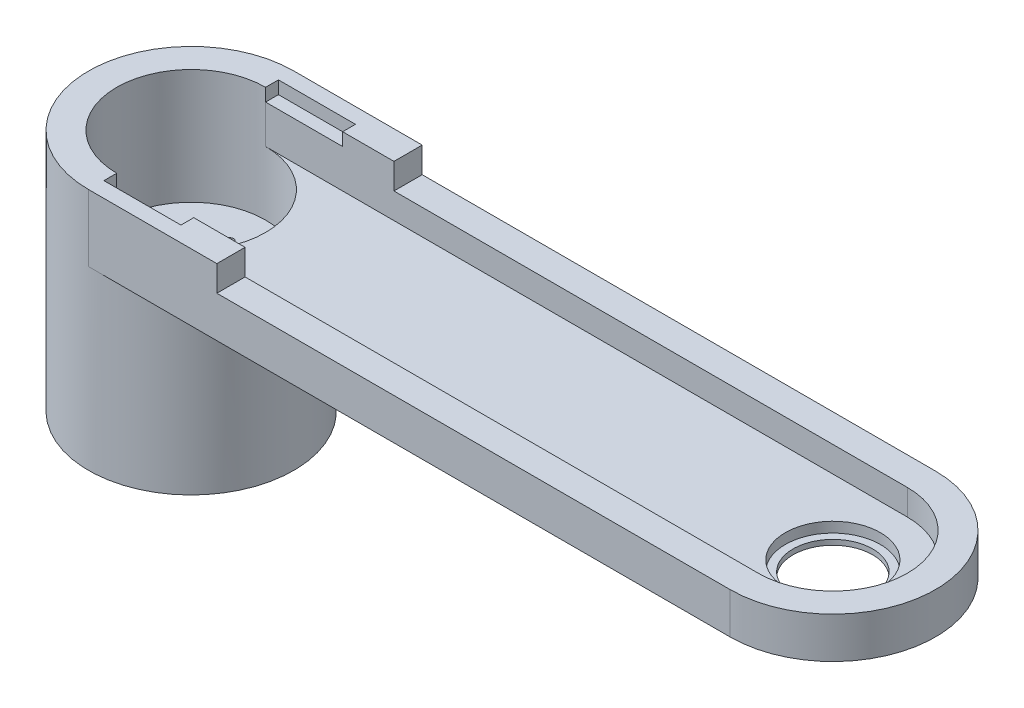
ISO-10303-21;
HEADER;
FILE_DESCRIPTION(('STEP AP214'),'2;1');
FILE_NAME('part.step','',(''),(''),'','','');
FILE_SCHEMA(('AUTOMOTIVE_DESIGN { 1 0 10303 214 1 1 1 1 }'));
ENDSEC;
DATA;
#1=APPLICATION_CONTEXT('core data for automotive mechanical design processes');
#2=APPLICATION_PROTOCOL_DEFINITION('international standard','automotive_design',2000,#1);
#3=PRODUCT_CONTEXT('',#1,'mechanical');
#4=PRODUCT('Part','Part','',(#3));
#5=PRODUCT_RELATED_PRODUCT_CATEGORY('part','',(#4));
#6=PRODUCT_DEFINITION_FORMATION('','',#4);
#7=PRODUCT_DEFINITION_CONTEXT('part definition',#1,'design');
#8=PRODUCT_DEFINITION('design','',#6,#7);
#9=PRODUCT_DEFINITION_SHAPE('','',#8);
#10=(LENGTH_UNIT() NAMED_UNIT(*) SI_UNIT(.MILLI.,.METRE.));
#11=(NAMED_UNIT(*) PLANE_ANGLE_UNIT() SI_UNIT($,.RADIAN.));
#12=(NAMED_UNIT(*) SI_UNIT($,.STERADIAN.) SOLID_ANGLE_UNIT());
#13=UNCERTAINTY_MEASURE_WITH_UNIT(LENGTH_MEASURE(1.E-05),#10,'distance_accuracy_value','');
#14=(GEOMETRIC_REPRESENTATION_CONTEXT(3) GLOBAL_UNCERTAINTY_ASSIGNED_CONTEXT((#13)) GLOBAL_UNIT_ASSIGNED_CONTEXT((#10,
#11,#12)) REPRESENTATION_CONTEXT('',''));
#15=CARTESIAN_POINT('',(0.,0.,0.));
#16=DIRECTION('',(0.,0.,1.));
#17=DIRECTION('',(1.,0.,0.));
#18=AXIS2_PLACEMENT_3D('',#15,#16,#17);
#19=CARTESIAN_POINT('',(250.,20.,0.));
#20=DIRECTION('',(0.,-1.,0.));
#21=DIRECTION('',(0.,0.,-1.));
#22=AXIS2_PLACEMENT_3D('',#19,#20,#21);
#23=CYLINDRICAL_SURFACE('',#22,40.);
#24=CARTESIAN_POINT('',(250.,10.,0.));
#25=DIRECTION('',(0.,1.,0.));
#26=DIRECTION('',(0.,0.,1.));
#27=AXIS2_PLACEMENT_3D('',#24,#25,#26);
#28=CIRCLE('',#27,40.);
#29=CARTESIAN_POINT('',(250.,10.,40.));
#30=VERTEX_POINT('',#29);
#31=CARTESIAN_POINT('',(250.,10.,-40.));
#32=VERTEX_POINT('',#31);
#33=EDGE_CURVE('E165',#30,#32,#28,.T.);
#34=ORIENTED_EDGE('',*,*,#33,.F.);
#35=DIRECTION('',(0.,-1.,0.));
#36=VECTOR('',#35,1.);
#37=CARTESIAN_POINT('',(250.,20.,40.));
#38=LINE('',#37,#36);
#39=CARTESIAN_POINT('',(250.,-6.,40.));
#40=VERTEX_POINT('',#39);
#41=EDGE_CURVE('E189',#30,#40,#38,.T.);
#42=ORIENTED_EDGE('',*,*,#41,.T.);
#43=CARTESIAN_POINT('',(250.,-6.,0.));
#44=DIRECTION('',(0.,-1.,0.));
#45=DIRECTION('',(0.,0.,-1.));
#46=AXIS2_PLACEMENT_3D('',#43,#44,#45);
#47=CIRCLE('',#46,40.);
#48=CARTESIAN_POINT('',(250.,-6.,-40.));
#49=VERTEX_POINT('',#48);
#50=EDGE_CURVE('E188',#49,#40,#47,.T.);
#51=ORIENTED_EDGE('',*,*,#50,.F.);
#52=DIRECTION('',(0.,-1.,0.));
#53=VECTOR('',#52,1.);
#54=CARTESIAN_POINT('',(250.,20.,-40.));
#55=LINE('',#54,#53);
#56=EDGE_CURVE('E181',#32,#49,#55,.T.);
#57=ORIENTED_EDGE('',*,*,#56,.F.);
#58=EDGE_LOOP('',(#34,#42,#51,#57));
#59=FACE_BOUND('',#58,.T.);
#60=ADVANCED_FACE('F37',(#59),#23,.T.);
#61=CARTESIAN_POINT('',(250.,20.,0.));
#62=DIRECTION('',(0.,-1.,0.));
#63=DIRECTION('',(0.,0.,-1.));
#64=AXIS2_PLACEMENT_3D('',#61,#62,#63);
#65=CYLINDRICAL_SURFACE('',#64,29.);
#66=DIRECTION('',(0.,-1.,0.));
#67=VECTOR('',#66,1.);
#68=CARTESIAN_POINT('',(250.,20.,29.));
#69=LINE('',#68,#67);
#70=CARTESIAN_POINT('',(250.,10.,29.));
#71=VERTEX_POINT('',#70);
#72=CARTESIAN_POINT('',(250.,0.,29.));
#73=VERTEX_POINT('',#72);
#74=EDGE_CURVE('E231',#71,#73,#69,.T.);
#75=ORIENTED_EDGE('',*,*,#74,.F.);
#76=CARTESIAN_POINT('',(250.,10.,0.));
#77=DIRECTION('',(0.,1.,0.));
#78=DIRECTION('',(0.,0.,1.));
#79=AXIS2_PLACEMENT_3D('',#76,#77,#78);
#80=CIRCLE('',#79,29.);
#81=CARTESIAN_POINT('',(250.,10.,-29.));
#82=VERTEX_POINT('',#81);
#83=EDGE_CURVE('E225',#71,#82,#80,.T.);
#84=ORIENTED_EDGE('',*,*,#83,.T.);
#85=DIRECTION('',(0.,-1.,0.));
#86=VECTOR('',#85,1.);
#87=CARTESIAN_POINT('',(250.,20.,-29.));
#88=LINE('',#87,#86);
#89=CARTESIAN_POINT('',(250.,0.,-29.));
#90=VERTEX_POINT('',#89);
#91=EDGE_CURVE('E223',#82,#90,#88,.T.);
#92=ORIENTED_EDGE('',*,*,#91,.T.);
#93=CARTESIAN_POINT('',(250.,0.,0.));
#94=DIRECTION('',(0.,1.,0.));
#95=DIRECTION('',(0.,0.,1.));
#96=AXIS2_PLACEMENT_3D('',#93,#94,#95);
#97=CIRCLE('',#96,29.);
#98=EDGE_CURVE('E319',#73,#90,#97,.T.);
#99=ORIENTED_EDGE('',*,*,#98,.F.);
#100=EDGE_LOOP('',(#75,#84,#92,#99));
#101=FACE_BOUND('',#100,.T.);
#102=ADVANCED_FACE('F229',(#101),#65,.F.);
#103=CARTESIAN_POINT('',(0.,20.,0.));
#104=DIRECTION('',(0.,-1.,0.));
#105=DIRECTION('',(0.,0.,-1.));
#106=AXIS2_PLACEMENT_3D('',#103,#104,#105);
#107=CYLINDRICAL_SURFACE('',#106,40.);
#108=CARTESIAN_POINT('',(0.,-6.,0.));
#109=DIRECTION('',(0.,1.,0.));
#110=DIRECTION('',(0.,0.,-1.));
#111=AXIS2_PLACEMENT_3D('',#108,#109,#110);
#112=CIRCLE('',#111,40.);
#113=CARTESIAN_POINT('',(0.,-6.,40.));
#114=VERTEX_POINT('',#113);
#115=CARTESIAN_POINT('',(0.,-6.,-40.));
#116=VERTEX_POINT('',#115);
#117=EDGE_CURVE('E295',#114,#116,#112,.T.);
#118=ORIENTED_EDGE('',*,*,#117,.F.);
#119=DIRECTION('',(0.,-1.,0.));
#120=VECTOR('',#119,1.);
#121=CARTESIAN_POINT('',(0.,20.,40.));
#122=LINE('',#121,#120);
#123=CARTESIAN_POINT('',(0.,20.,40.));
#124=VERTEX_POINT('',#123);
#125=EDGE_CURVE('E192',#124,#114,#122,.T.);
#126=ORIENTED_EDGE('',*,*,#125,.F.);
#127=CARTESIAN_POINT('',(0.,20.,0.));
#128=DIRECTION('',(0.,1.,0.));
#129=DIRECTION('',(0.,0.,1.));
#130=AXIS2_PLACEMENT_3D('',#127,#128,#129);
#131=CIRCLE('',#130,40.);
#132=CARTESIAN_POINT('',(0.,20.,-40.));
#133=VERTEX_POINT('',#132);
#134=EDGE_CURVE('E333',#133,#124,#131,.T.);
#135=ORIENTED_EDGE('',*,*,#134,.F.);
#136=DIRECTION('',(0.,-1.,0.));
#137=VECTOR('',#136,1.);
#138=CARTESIAN_POINT('',(0.,20.,-40.));
#139=LINE('',#138,#137);
#140=EDGE_CURVE('E190',#133,#116,#139,.T.);
#141=ORIENTED_EDGE('',*,*,#140,.T.);
#142=EDGE_LOOP('',(#118,#126,#135,#141));
#143=FACE_BOUND('',#142,.T.);
#144=CARTESIAN_POINT('',(0.,-74.8,0.));
#145=DIRECTION('',(0.,-1.,0.));
#146=DIRECTION('',(0.,0.,-1.));
#147=AXIS2_PLACEMENT_3D('',#144,#145,#146);
#148=CIRCLE('',#147,40.);
#149=CARTESIAN_POINT('',(0.,-74.8,-40.));
#150=VERTEX_POINT('',#149);
#151=EDGE_CURVE('E418',#150,#150,#148,.T.);
#152=ORIENTED_EDGE('',*,*,#151,.F.);
#153=EDGE_LOOP('',(#152));
#154=FACE_BOUND('',#153,.T.);
#155=ADVANCED_FACE('F39',(#143,#154),#107,.T.);
#156=CARTESIAN_POINT('',(0.,20.,0.));
#157=DIRECTION('',(0.,1.,0.));
#158=DIRECTION('',(0.,0.,1.));
#159=AXIS2_PLACEMENT_3D('',#156,#157,#158);
#160=PLANE('',#159);
#161=DIRECTION('',(0.,0.,1.));
#162=VECTOR('',#161,1.);
#163=CARTESIAN_POINT('',(50.,20.,-40.));
#164=LINE('',#163,#162);
#165=CARTESIAN_POINT('',(50.,20.,-40.));
#166=VERTEX_POINT('',#165);
#167=CARTESIAN_POINT('',(50.,20.,-29.));
#168=VERTEX_POINT('',#167);
#169=EDGE_CURVE('E175',#166,#168,#164,.T.);
#170=ORIENTED_EDGE('',*,*,#169,.F.);
#171=DIRECTION('',(-1.,0.,0.));
#172=VECTOR('',#171,1.);
#173=CARTESIAN_POINT('',(0.,20.,-40.));
#174=LINE('',#173,#172);
#175=EDGE_CURVE('E194',#166,#133,#174,.T.);
#176=ORIENTED_EDGE('',*,*,#175,.T.);
#177=ORIENTED_EDGE('',*,*,#134,.T.);
#178=DIRECTION('',(1.,0.,0.));
#179=VECTOR('',#178,1.);
#180=CARTESIAN_POINT('',(0.,20.,40.));
#181=LINE('',#180,#179);
#182=CARTESIAN_POINT('',(50.,20.,40.));
#183=VERTEX_POINT('',#182);
#184=EDGE_CURVE('E336',#124,#183,#181,.T.);
#185=ORIENTED_EDGE('',*,*,#184,.T.);
#186=CARTESIAN_POINT('',(50.,20.,29.));
#187=VERTEX_POINT('',#186);
#188=EDGE_CURVE('E416',#187,#183,#164,.T.);
#189=ORIENTED_EDGE('',*,*,#188,.F.);
#190=DIRECTION('',(1.,0.,0.));
#191=VECTOR('',#190,1.);
#192=CARTESIAN_POINT('',(0.,20.,29.));
#193=LINE('',#192,#191);
#194=CARTESIAN_POINT('',(30.,20.,29.));
#195=VERTEX_POINT('',#194);
#196=EDGE_CURVE('E310',#195,#187,#193,.T.);
#197=ORIENTED_EDGE('',*,*,#196,.F.);
#198=DIRECTION('',(0.,0.,1.));
#199=VECTOR('',#198,1.);
#200=CARTESIAN_POINT('',(30.,20.,-69.4138126514911));
#201=LINE('',#200,#199);
#202=CARTESIAN_POINT('',(30.,20.,34.));
#203=VERTEX_POINT('',#202);
#204=EDGE_CURVE('E281',#195,#203,#201,.T.);
#205=ORIENTED_EDGE('',*,*,#204,.T.);
#206=DIRECTION('',(1.,0.,0.));
#207=VECTOR('',#206,1.);
#208=CARTESIAN_POINT('',(0.,20.,34.));
#209=LINE('',#208,#207);
#210=CARTESIAN_POINT('',(0.,20.,34.));
#211=VERTEX_POINT('',#210);
#212=EDGE_CURVE('E252',#211,#203,#209,.T.);
#213=ORIENTED_EDGE('',*,*,#212,.F.);
#214=DIRECTION('',(0.,0.,1.));
#215=VECTOR('',#214,1.);
#216=CARTESIAN_POINT('',(0.,20.,-69.4138126514911));
#217=LINE('',#216,#215);
#218=CARTESIAN_POINT('',(0.,20.,29.));
#219=VERTEX_POINT('',#218);
#220=EDGE_CURVE('E277',#219,#211,#217,.T.);
#221=ORIENTED_EDGE('',*,*,#220,.F.);
#222=CARTESIAN_POINT('',(0.,20.,0.));
#223=DIRECTION('',(0.,1.,0.));
#224=DIRECTION('',(0.,0.,1.));
#225=AXIS2_PLACEMENT_3D('',#222,#223,#224);
#226=CIRCLE('',#225,29.);
#227=CARTESIAN_POINT('',(0.,20.,-29.));
#228=VERTEX_POINT('',#227);
#229=EDGE_CURVE('E307',#228,#219,#226,.T.);
#230=ORIENTED_EDGE('',*,*,#229,.F.);
#231=CARTESIAN_POINT('',(0.,20.,-34.));
#232=VERTEX_POINT('',#231);
#233=EDGE_CURVE('E270',#232,#228,#217,.T.);
#234=ORIENTED_EDGE('',*,*,#233,.F.);
#235=DIRECTION('',(1.,0.,0.));
#236=VECTOR('',#235,1.);
#237=CARTESIAN_POINT('',(0.,20.,-34.));
#238=LINE('',#237,#236);
#239=CARTESIAN_POINT('',(30.,20.,-34.));
#240=VERTEX_POINT('',#239);
#241=EDGE_CURVE('E269',#232,#240,#238,.T.);
#242=ORIENTED_EDGE('',*,*,#241,.T.);
#243=CARTESIAN_POINT('',(30.,20.,-29.));
#244=VERTEX_POINT('',#243);
#245=EDGE_CURVE('E278',#240,#244,#201,.T.);
#246=ORIENTED_EDGE('',*,*,#245,.T.);
#247=DIRECTION('',(-1.,0.,0.));
#248=VECTOR('',#247,1.);
#249=CARTESIAN_POINT('',(0.,20.,-29.));
#250=LINE('',#249,#248);
#251=EDGE_CURVE('E314',#168,#244,#250,.T.);
#252=ORIENTED_EDGE('',*,*,#251,.F.);
#253=EDGE_LOOP('',(#170,#176,#177,#185,#189,#197,#205,#213,#221,#230,#234,#242,#246,#252));
#254=FACE_BOUND('',#253,.T.);
#255=ADVANCED_FACE('F341',(#254),#160,.T.);
#256=CARTESIAN_POINT('',(0.,20.,40.));
#257=DIRECTION('',(0.,0.,-1.));
#258=DIRECTION('',(-1.,0.,0.));
#259=AXIS2_PLACEMENT_3D('',#256,#257,#258);
#260=PLANE('',#259);
#261=DIRECTION('',(1.,0.,0.));
#262=VECTOR('',#261,1.);
#263=CARTESIAN_POINT('',(50.,10.,40.));
#264=LINE('',#263,#262);
#265=CARTESIAN_POINT('',(50.,10.,40.));
#266=VERTEX_POINT('',#265);
#267=EDGE_CURVE('E171',#266,#30,#264,.T.);
#268=ORIENTED_EDGE('',*,*,#267,.F.);
#269=DIRECTION('',(0.,1.,0.));
#270=VECTOR('',#269,1.);
#271=CARTESIAN_POINT('',(50.,10.,40.));
#272=LINE('',#271,#270);
#273=EDGE_CURVE('E233',#266,#183,#272,.T.);
#274=ORIENTED_EDGE('',*,*,#273,.T.);
#275=ORIENTED_EDGE('',*,*,#184,.F.);
#276=ORIENTED_EDGE('',*,*,#125,.T.);
#277=DIRECTION('',(-1.,0.,0.));
#278=VECTOR('',#277,1.);
#279=CARTESIAN_POINT('',(0.,-6.,40.));
#280=LINE('',#279,#278);
#281=EDGE_CURVE('E292',#40,#114,#280,.T.);
#282=ORIENTED_EDGE('',*,*,#281,.F.);
#283=ORIENTED_EDGE('',*,*,#41,.F.);
#284=EDGE_LOOP('',(#268,#274,#275,#276,#282,#283));
#285=FACE_BOUND('',#284,.T.);
#286=ADVANCED_FACE('F349',(#285),#260,.F.);
#287=CARTESIAN_POINT('',(0.,20.,-40.));
#288=DIRECTION('',(0.,0.,1.));
#289=DIRECTION('',(1.,0.,0.));
#290=AXIS2_PLACEMENT_3D('',#287,#288,#289);
#291=PLANE('',#290);
#292=ORIENTED_EDGE('',*,*,#175,.F.);
#293=DIRECTION('',(0.,1.,0.));
#294=VECTOR('',#293,1.);
#295=CARTESIAN_POINT('',(50.,10.,-40.));
#296=LINE('',#295,#294);
#297=CARTESIAN_POINT('',(50.,10.,-40.));
#298=VERTEX_POINT('',#297);
#299=EDGE_CURVE('E183',#298,#166,#296,.T.);
#300=ORIENTED_EDGE('',*,*,#299,.F.);
#301=DIRECTION('',(-1.,0.,0.));
#302=VECTOR('',#301,1.);
#303=CARTESIAN_POINT('',(250.,10.,-40.));
#304=LINE('',#303,#302);
#305=EDGE_CURVE('E168',#32,#298,#304,.T.);
#306=ORIENTED_EDGE('',*,*,#305,.F.);
#307=ORIENTED_EDGE('',*,*,#56,.T.);
#308=DIRECTION('',(1.,0.,0.));
#309=VECTOR('',#308,1.);
#310=CARTESIAN_POINT('',(250.,-6.,-40.));
#311=LINE('',#310,#309);
#312=EDGE_CURVE('E298',#116,#49,#311,.T.);
#313=ORIENTED_EDGE('',*,*,#312,.F.);
#314=ORIENTED_EDGE('',*,*,#140,.F.);
#315=EDGE_LOOP('',(#292,#300,#306,#307,#313,#314));
#316=FACE_BOUND('',#315,.T.);
#317=ADVANCED_FACE('F179',(#316),#291,.F.);
#318=CARTESIAN_POINT('',(0.,20.,0.));
#319=DIRECTION('',(0.,-1.,0.));
#320=DIRECTION('',(0.,0.,-1.));
#321=AXIS2_PLACEMENT_3D('',#318,#319,#320);
#322=CYLINDRICAL_SURFACE('',#321,29.);
#323=DIRECTION('',(0.,-1.,0.));
#324=VECTOR('',#323,1.);
#325=CARTESIAN_POINT('',(0.,20.,29.));
#326=LINE('',#325,#324);
#327=CARTESIAN_POINT('',(0.,15.,29.));
#328=VERTEX_POINT('',#327);
#329=EDGE_CURVE('E330',#219,#328,#326,.T.);
#330=ORIENTED_EDGE('',*,*,#329,.T.);
#331=CARTESIAN_POINT('',(0.,0.,29.));
#332=VERTEX_POINT('',#331);
#333=EDGE_CURVE('E329',#328,#332,#326,.T.);
#334=ORIENTED_EDGE('',*,*,#333,.T.);
#335=CARTESIAN_POINT('',(0.,0.,0.));
#336=DIRECTION('',(0.,-1.,0.));
#337=DIRECTION('',(0.,0.,-1.));
#338=AXIS2_PLACEMENT_3D('',#335,#336,#337);
#339=CIRCLE('',#338,29.);
#340=CARTESIAN_POINT('',(0.,0.,-29.));
#341=VERTEX_POINT('',#340);
#342=EDGE_CURVE('E303',#341,#332,#339,.T.);
#343=ORIENTED_EDGE('',*,*,#342,.F.);
#344=DIRECTION('',(0.,-1.,0.));
#345=VECTOR('',#344,1.);
#346=CARTESIAN_POINT('',(0.,20.,-29.));
#347=LINE('',#346,#345);
#348=CARTESIAN_POINT('',(0.,15.,-29.));
#349=VERTEX_POINT('',#348);
#350=EDGE_CURVE('E316',#349,#341,#347,.T.);
#351=ORIENTED_EDGE('',*,*,#350,.F.);
#352=EDGE_CURVE('E324',#228,#349,#347,.T.);
#353=ORIENTED_EDGE('',*,*,#352,.F.);
#354=ORIENTED_EDGE('',*,*,#229,.T.);
#355=EDGE_LOOP('',(#330,#334,#343,#351,#353,#354));
#356=FACE_BOUND('',#355,.T.);
#357=CARTESIAN_POINT('',(0.,-24.8,0.));
#358=DIRECTION('',(0.,-1.,0.));
#359=DIRECTION('',(0.,0.,-1.));
#360=AXIS2_PLACEMENT_3D('',#357,#358,#359);
#361=CIRCLE('',#360,29.);
#362=CARTESIAN_POINT('',(0.,-24.8,-29.));
#363=VERTEX_POINT('',#362);
#364=EDGE_CURVE('E300',#363,#363,#361,.T.);
#365=ORIENTED_EDGE('',*,*,#364,.T.);
#366=EDGE_LOOP('',(#365));
#367=FACE_BOUND('',#366,.T.);
#368=ADVANCED_FACE('F382',(#356,#367),#322,.F.);
#369=CARTESIAN_POINT('',(0.,20.,29.));
#370=DIRECTION('',(0.,0.,-1.));
#371=DIRECTION('',(-1.,0.,0.));
#372=AXIS2_PLACEMENT_3D('',#369,#370,#371);
#373=PLANE('',#372);
#374=DIRECTION('',(0.,1.,0.));
#375=VECTOR('',#374,1.);
#376=CARTESIAN_POINT('',(50.,20.,29.));
#377=LINE('',#376,#375);
#378=CARTESIAN_POINT('',(50.,10.,29.));
#379=VERTEX_POINT('',#378);
#380=EDGE_CURVE('E235',#379,#187,#377,.T.);
#381=ORIENTED_EDGE('',*,*,#380,.F.);
#382=DIRECTION('',(1.,0.,0.));
#383=VECTOR('',#382,1.);
#384=CARTESIAN_POINT('',(0.,10.,29.));
#385=LINE('',#384,#383);
#386=EDGE_CURVE('E232',#379,#71,#385,.T.);
#387=ORIENTED_EDGE('',*,*,#386,.T.);
#388=ORIENTED_EDGE('',*,*,#74,.T.);
#389=DIRECTION('',(1.,0.,0.));
#390=VECTOR('',#389,1.);
#391=CARTESIAN_POINT('',(0.,0.,29.));
#392=LINE('',#391,#390);
#393=EDGE_CURVE('E306',#332,#73,#392,.T.);
#394=ORIENTED_EDGE('',*,*,#393,.F.);
#395=ORIENTED_EDGE('',*,*,#333,.F.);
#396=DIRECTION('',(-1.,0.,0.));
#397=VECTOR('',#396,1.);
#398=CARTESIAN_POINT('',(0.,15.,29.));
#399=LINE('',#398,#397);
#400=CARTESIAN_POINT('',(30.,15.,29.));
#401=VERTEX_POINT('',#400);
#402=EDGE_CURVE('E288',#401,#328,#399,.T.);
#403=ORIENTED_EDGE('',*,*,#402,.F.);
#404=DIRECTION('',(0.,-1.,0.));
#405=VECTOR('',#404,1.);
#406=CARTESIAN_POINT('',(30.,20.,29.));
#407=LINE('',#406,#405);
#408=EDGE_CURVE('E208',#195,#401,#407,.T.);
#409=ORIENTED_EDGE('',*,*,#408,.F.);
#410=ORIENTED_EDGE('',*,*,#196,.T.);
#411=EDGE_LOOP('',(#381,#387,#388,#394,#395,#403,#409,#410));
#412=FACE_BOUND('',#411,.T.);
#413=ADVANCED_FACE('F389',(#412),#373,.T.);
#414=CARTESIAN_POINT('',(0.,20.,-29.));
#415=DIRECTION('',(0.,0.,1.));
#416=DIRECTION('',(1.,0.,0.));
#417=AXIS2_PLACEMENT_3D('',#414,#415,#416);
#418=PLANE('',#417);
#419=DIRECTION('',(0.,-1.,0.));
#420=VECTOR('',#419,1.);
#421=CARTESIAN_POINT('',(50.,20.,-29.));
#422=LINE('',#421,#420);
#423=CARTESIAN_POINT('',(50.,10.,-29.));
#424=VERTEX_POINT('',#423);
#425=EDGE_CURVE('E13',#168,#424,#422,.T.);
#426=ORIENTED_EDGE('',*,*,#425,.F.);
#427=ORIENTED_EDGE('',*,*,#251,.T.);
#428=DIRECTION('',(0.,1.,0.));
#429=VECTOR('',#428,1.);
#430=CARTESIAN_POINT('',(30.,20.,-29.));
#431=LINE('',#430,#429);
#432=CARTESIAN_POINT('',(30.,15.,-29.));
#433=VERTEX_POINT('',#432);
#434=EDGE_CURVE('E214',#433,#244,#431,.T.);
#435=ORIENTED_EDGE('',*,*,#434,.F.);
#436=DIRECTION('',(1.,0.,0.));
#437=VECTOR('',#436,1.);
#438=CARTESIAN_POINT('',(0.,15.,-29.));
#439=LINE('',#438,#437);
#440=EDGE_CURVE('E199',#349,#433,#439,.T.);
#441=ORIENTED_EDGE('',*,*,#440,.F.);
#442=ORIENTED_EDGE('',*,*,#350,.T.);
#443=DIRECTION('',(-1.,0.,0.));
#444=VECTOR('',#443,1.);
#445=CARTESIAN_POINT('',(0.,0.,-29.));
#446=LINE('',#445,#444);
#447=EDGE_CURVE('E311',#90,#341,#446,.T.);
#448=ORIENTED_EDGE('',*,*,#447,.F.);
#449=ORIENTED_EDGE('',*,*,#91,.F.);
#450=DIRECTION('',(-1.,0.,0.));
#451=VECTOR('',#450,1.);
#452=CARTESIAN_POINT('',(0.,10.,-29.));
#453=LINE('',#452,#451);
#454=EDGE_CURVE('E45',#82,#424,#453,.T.);
#455=ORIENTED_EDGE('',*,*,#454,.T.);
#456=EDGE_LOOP('',(#426,#427,#435,#441,#442,#448,#449,#455));
#457=FACE_BOUND('',#456,.T.);
#458=ADVANCED_FACE('F220',(#457),#418,.T.);
#459=CARTESIAN_POINT('',(0.,0.,0.));
#460=DIRECTION('',(0.,-1.,0.));
#461=DIRECTION('',(0.,0.,-1.));
#462=AXIS2_PLACEMENT_3D('',#459,#460,#461);
#463=PLANE('',#462);
#464=CARTESIAN_POINT('',(250.,0.,0.));
#465=DIRECTION('',(0.,1.,0.));
#466=DIRECTION('',(0.,0.,1.));
#467=AXIS2_PLACEMENT_3D('',#464,#465,#466);
#468=CIRCLE('',#467,18.5);
#469=CARTESIAN_POINT('',(250.,0.,18.5));
#470=VERTEX_POINT('',#469);
#471=EDGE_CURVE('E248',#470,#470,#468,.T.);
#472=ORIENTED_EDGE('',*,*,#471,.F.);
#473=EDGE_LOOP('',(#472));
#474=FACE_BOUND('',#473,.T.);
#475=ORIENTED_EDGE('',*,*,#342,.T.);
#476=ORIENTED_EDGE('',*,*,#393,.T.);
#477=ORIENTED_EDGE('',*,*,#98,.T.);
#478=ORIENTED_EDGE('',*,*,#447,.T.);
#479=EDGE_LOOP('',(#475,#476,#477,#478));
#480=FACE_BOUND('',#479,.T.);
#481=ADVANCED_FACE('F365',(#474,#480),#463,.F.);
#482=CARTESIAN_POINT('',(0.,-24.8,0.));
#483=DIRECTION('',(0.,-1.,0.));
#484=DIRECTION('',(0.,0.,-1.));
#485=AXIS2_PLACEMENT_3D('',#482,#483,#484);
#486=PLANE('',#485);
#487=CARTESIAN_POINT('',(15.0000000000004,-24.8,-4.24488671257339E-13));
#488=DIRECTION('',(0.,-1.,0.));
#489=DIRECTION('',(0.,0.,-1.));
#490=AXIS2_PLACEMENT_3D('',#487,#488,#489);
#491=CIRCLE('',#490,1.50000000000033);
#492=CARTESIAN_POINT('',(15.0000000000004,-24.8,-1.50000000000076));
#493=VERTEX_POINT('',#492);
#494=EDGE_CURVE('E203',#493,#493,#491,.T.);
#495=ORIENTED_EDGE('',*,*,#494,.T.);
#496=EDGE_LOOP('',(#495));
#497=FACE_BOUND('',#496,.T.);
#498=CARTESIAN_POINT('',(8.48977342514678E-13,-24.8,15.));
#499=DIRECTION('',(0.,-1.,0.));
#500=DIRECTION('',(0.,0.,-1.));
#501=AXIS2_PLACEMENT_3D('',#498,#499,#500);
#502=CIRCLE('',#501,1.50000000000091);
#503=CARTESIAN_POINT('',(8.48977342514678E-13,-24.8,13.4999999999991));
#504=VERTEX_POINT('',#503);
#505=EDGE_CURVE('E207',#504,#504,#502,.T.);
#506=ORIENTED_EDGE('',*,*,#505,.T.);
#507=EDGE_LOOP('',(#506));
#508=FACE_BOUND('',#507,.T.);
#509=CARTESIAN_POINT('',(-14.9999999999996,-24.8,4.2632564145606E-13));
#510=DIRECTION('',(0.,-1.,0.));
#511=DIRECTION('',(0.,0.,-1.));
#512=AXIS2_PLACEMENT_3D('',#509,#510,#511);
#513=CIRCLE('',#512,1.50000000000068);
#514=CARTESIAN_POINT('',(-14.9999999999996,-24.8,-1.50000000000026));
#515=VERTEX_POINT('',#514);
#516=EDGE_CURVE('E204',#515,#515,#513,.T.);
#517=ORIENTED_EDGE('',*,*,#516,.T.);
#518=EDGE_LOOP('',(#517));
#519=FACE_BOUND('',#518,.T.);
#520=CARTESIAN_POINT('',(0.,-24.8,-15.));
#521=DIRECTION('',(0.,-1.,0.));
#522=DIRECTION('',(0.,0.,-1.));
#523=AXIS2_PLACEMENT_3D('',#520,#521,#522);
#524=CIRCLE('',#523,1.5);
#525=CARTESIAN_POINT('',(0.,-24.8,-16.5));
#526=VERTEX_POINT('',#525);
#527=EDGE_CURVE('E200',#526,#526,#524,.T.);
#528=ORIENTED_EDGE('',*,*,#527,.T.);
#529=EDGE_LOOP('',(#528));
#530=FACE_BOUND('',#529,.T.);
#531=ORIENTED_EDGE('',*,*,#364,.F.);
#532=EDGE_LOOP('',(#531));
#533=FACE_BOUND('',#532,.T.);
#534=ADVANCED_FACE('F354',(#497,#508,#519,#530,#533),#486,.F.);
#535=CARTESIAN_POINT('',(250.,-6.,0.));
#536=DIRECTION('',(0.,-1.,0.));
#537=DIRECTION('',(0.,0.,-1.));
#538=AXIS2_PLACEMENT_3D('',#535,#536,#537);
#539=PLANE('',#538);
#540=CARTESIAN_POINT('',(250.,-6.,0.));
#541=DIRECTION('',(0.,-1.,0.));
#542=DIRECTION('',(0.,0.,-1.));
#543=AXIS2_PLACEMENT_3D('',#540,#541,#542);
#544=CIRCLE('',#543,15.5);
#545=CARTESIAN_POINT('',(250.,-6.,-15.5));
#546=VERTEX_POINT('',#545);
#547=EDGE_CURVE('E245',#546,#546,#544,.T.);
#548=ORIENTED_EDGE('',*,*,#547,.F.);
#549=EDGE_LOOP('',(#548));
#550=FACE_BOUND('',#549,.T.);
#551=ORIENTED_EDGE('',*,*,#50,.T.);
#552=ORIENTED_EDGE('',*,*,#281,.T.);
#553=ORIENTED_EDGE('',*,*,#117,.T.);
#554=ORIENTED_EDGE('',*,*,#312,.T.);
#555=EDGE_LOOP('',(#551,#552,#553,#554));
#556=FACE_BOUND('',#555,.T.);
#557=ADVANCED_FACE('F351',(#550,#556),#539,.T.);
#558=CARTESIAN_POINT('',(0.,-29.8,-15.));
#559=DIRECTION('',(0.,1.,0.));
#560=DIRECTION('',(0.,0.,1.));
#561=AXIS2_PLACEMENT_3D('',#558,#559,#560);
#562=CYLINDRICAL_SURFACE('',#561,1.5);
#563=ORIENTED_EDGE('',*,*,#527,.F.);
#564=EDGE_LOOP('',(#563));
#565=FACE_BOUND('',#564,.T.);
#566=CARTESIAN_POINT('',(0.,-74.8,-15.));
#567=DIRECTION('',(0.,-1.,0.));
#568=DIRECTION('',(0.,0.,-1.));
#569=AXIS2_PLACEMENT_3D('',#566,#567,#568);
#570=CIRCLE('',#569,1.5);
#571=CARTESIAN_POINT('',(0.,-74.8,-16.5));
#572=VERTEX_POINT('',#571);
#573=EDGE_CURVE('E425',#572,#572,#570,.T.);
#574=ORIENTED_EDGE('',*,*,#573,.T.);
#575=EDGE_LOOP('',(#574));
#576=FACE_BOUND('',#575,.T.);
#577=ADVANCED_FACE('F353',(#565,#576),#562,.F.);
#578=CARTESIAN_POINT('',(-14.9999999999996,-29.8,4.2632564145606E-13));
#579=DIRECTION('',(0.,1.,0.));
#580=DIRECTION('',(0.,0.,1.));
#581=AXIS2_PLACEMENT_3D('',#578,#579,#580);
#582=CYLINDRICAL_SURFACE('',#581,1.50000000000068);
#583=ORIENTED_EDGE('',*,*,#516,.F.);
#584=EDGE_LOOP('',(#583));
#585=FACE_BOUND('',#584,.T.);
#586=CARTESIAN_POINT('',(-14.9999999999996,-74.8,4.2632564145606E-13));
#587=DIRECTION('',(0.,-1.,0.));
#588=DIRECTION('',(0.,0.,-1.));
#589=AXIS2_PLACEMENT_3D('',#586,#587,#588);
#590=CIRCLE('',#589,1.50000000000068);
#591=CARTESIAN_POINT('',(-14.9999999999996,-74.8,-1.50000000000026));
#592=VERTEX_POINT('',#591);
#593=EDGE_CURVE('E420',#592,#592,#590,.T.);
#594=ORIENTED_EDGE('',*,*,#593,.T.);
#595=EDGE_LOOP('',(#594));
#596=FACE_BOUND('',#595,.T.);
#597=ADVANCED_FACE('F362',(#585,#596),#582,.F.);
#598=CARTESIAN_POINT('',(8.48977342514678E-13,-29.8,15.));
#599=DIRECTION('',(0.,1.,0.));
#600=DIRECTION('',(0.,0.,1.));
#601=AXIS2_PLACEMENT_3D('',#598,#599,#600);
#602=CYLINDRICAL_SURFACE('',#601,1.50000000000091);
#603=ORIENTED_EDGE('',*,*,#505,.F.);
#604=EDGE_LOOP('',(#603));
#605=FACE_BOUND('',#604,.T.);
#606=CARTESIAN_POINT('',(8.48977342514678E-13,-74.8,15.));
#607=DIRECTION('',(0.,-1.,0.));
#608=DIRECTION('',(0.,0.,-1.));
#609=AXIS2_PLACEMENT_3D('',#606,#607,#608);
#610=CIRCLE('',#609,1.50000000000091);
#611=CARTESIAN_POINT('',(8.48977342514678E-13,-74.8,13.4999999999991));
#612=VERTEX_POINT('',#611);
#613=EDGE_CURVE('E433',#612,#612,#610,.T.);
#614=ORIENTED_EDGE('',*,*,#613,.T.);
#615=EDGE_LOOP('',(#614));
#616=FACE_BOUND('',#615,.T.);
#617=ADVANCED_FACE('F463',(#605,#616),#602,.F.);
#618=CARTESIAN_POINT('',(15.0000000000004,-29.8,-4.24488671257339E-13));
#619=DIRECTION('',(0.,1.,0.));
#620=DIRECTION('',(0.,0.,1.));
#621=AXIS2_PLACEMENT_3D('',#618,#619,#620);
#622=CYLINDRICAL_SURFACE('',#621,1.50000000000033);
#623=ORIENTED_EDGE('',*,*,#494,.F.);
#624=EDGE_LOOP('',(#623));
#625=FACE_BOUND('',#624,.T.);
#626=CARTESIAN_POINT('',(15.0000000000004,-74.8,-4.24488671257339E-13));
#627=DIRECTION('',(0.,-1.,0.));
#628=DIRECTION('',(0.,0.,-1.));
#629=AXIS2_PLACEMENT_3D('',#626,#627,#628);
#630=CIRCLE('',#629,1.50000000000033);
#631=CARTESIAN_POINT('',(15.0000000000004,-74.8,-1.50000000000076));
#632=VERTEX_POINT('',#631);
#633=EDGE_CURVE('E430',#632,#632,#630,.T.);
#634=ORIENTED_EDGE('',*,*,#633,.T.);
#635=EDGE_LOOP('',(#634));
#636=FACE_BOUND('',#635,.T.);
#637=ADVANCED_FACE('F465',(#625,#636),#622,.F.);
#638=CARTESIAN_POINT('',(0.,15.,-69.4138126514911));
#639=DIRECTION('',(0.,-1.,0.));
#640=DIRECTION('',(0.,0.,-1.));
#641=AXIS2_PLACEMENT_3D('',#638,#639,#640);
#642=PLANE('',#641);
#643=ORIENTED_EDGE('',*,*,#440,.T.);
#644=DIRECTION('',(0.,0.,1.));
#645=VECTOR('',#644,1.);
#646=CARTESIAN_POINT('',(30.,15.,-69.4138126514911));
#647=LINE('',#646,#645);
#648=CARTESIAN_POINT('',(30.,15.,-34.));
#649=VERTEX_POINT('',#648);
#650=EDGE_CURVE('E282',#649,#433,#647,.T.);
#651=ORIENTED_EDGE('',*,*,#650,.F.);
#652=DIRECTION('',(-1.,0.,0.));
#653=VECTOR('',#652,1.);
#654=CARTESIAN_POINT('',(0.,15.,-34.));
#655=LINE('',#654,#653);
#656=CARTESIAN_POINT('',(0.,15.,-34.));
#657=VERTEX_POINT('',#656);
#658=EDGE_CURVE('E275',#649,#657,#655,.T.);
#659=ORIENTED_EDGE('',*,*,#658,.T.);
#660=DIRECTION('',(0.,0.,1.));
#661=VECTOR('',#660,1.);
#662=CARTESIAN_POINT('',(0.,15.,-69.4138126514911));
#663=LINE('',#662,#661);
#664=EDGE_CURVE('E285',#657,#349,#663,.T.);
#665=ORIENTED_EDGE('',*,*,#664,.T.);
#666=EDGE_LOOP('',(#643,#651,#659,#665));
#667=FACE_BOUND('',#666,.T.);
#668=ADVANCED_FACE('F472',(#667),#642,.F.);
#669=CARTESIAN_POINT('',(30.,20.,-69.4138126514911));
#670=DIRECTION('',(1.,0.,0.));
#671=DIRECTION('',(0.,0.,-1.));
#672=AXIS2_PLACEMENT_3D('',#669,#670,#671);
#673=PLANE('',#672);
#674=ORIENTED_EDGE('',*,*,#434,.T.);
#675=ORIENTED_EDGE('',*,*,#245,.F.);
#676=DIRECTION('',(0.,-1.,0.));
#677=VECTOR('',#676,1.);
#678=CARTESIAN_POINT('',(30.,20.,-34.));
#679=LINE('',#678,#677);
#680=EDGE_CURVE('E267',#240,#649,#679,.T.);
#681=ORIENTED_EDGE('',*,*,#680,.T.);
#682=ORIENTED_EDGE('',*,*,#650,.T.);
#683=EDGE_LOOP('',(#674,#675,#681,#682));
#684=FACE_BOUND('',#683,.T.);
#685=ADVANCED_FACE('F483',(#684),#673,.F.);
#686=CARTESIAN_POINT('',(0.,20.,-69.4138126514911));
#687=DIRECTION('',(-1.,0.,0.));
#688=DIRECTION('',(0.,-1.,0.));
#689=AXIS2_PLACEMENT_3D('',#686,#687,#688);
#690=PLANE('',#689);
#691=ORIENTED_EDGE('',*,*,#352,.T.);
#692=ORIENTED_EDGE('',*,*,#664,.F.);
#693=DIRECTION('',(0.,1.,0.));
#694=VECTOR('',#693,1.);
#695=CARTESIAN_POINT('',(0.,20.,-34.));
#696=LINE('',#695,#694);
#697=EDGE_CURVE('E273',#657,#232,#696,.T.);
#698=ORIENTED_EDGE('',*,*,#697,.T.);
#699=ORIENTED_EDGE('',*,*,#233,.T.);
#700=EDGE_LOOP('',(#691,#692,#698,#699));
#701=FACE_BOUND('',#700,.T.);
#702=ADVANCED_FACE('F479',(#701),#690,.F.);
#703=CARTESIAN_POINT('',(0.,20.,-34.));
#704=DIRECTION('',(0.,0.,1.));
#705=DIRECTION('',(1.,0.,0.));
#706=AXIS2_PLACEMENT_3D('',#703,#704,#705);
#707=PLANE('',#706);
#708=ORIENTED_EDGE('',*,*,#697,.F.);
#709=ORIENTED_EDGE('',*,*,#658,.F.);
#710=ORIENTED_EDGE('',*,*,#680,.F.);
#711=ORIENTED_EDGE('',*,*,#241,.F.);
#712=EDGE_LOOP('',(#708,#709,#710,#711));
#713=FACE_BOUND('',#712,.T.);
#714=ADVANCED_FACE('F482',(#713),#707,.T.);
#715=ORIENTED_EDGE('',*,*,#329,.F.);
#716=ORIENTED_EDGE('',*,*,#220,.T.);
#717=DIRECTION('',(0.,1.,0.));
#718=VECTOR('',#717,1.);
#719=CARTESIAN_POINT('',(0.,20.,34.));
#720=LINE('',#719,#718);
#721=CARTESIAN_POINT('',(0.,15.,34.));
#722=VERTEX_POINT('',#721);
#723=EDGE_CURVE('E261',#722,#211,#720,.T.);
#724=ORIENTED_EDGE('',*,*,#723,.F.);
#725=EDGE_CURVE('E264',#328,#722,#663,.T.);
#726=ORIENTED_EDGE('',*,*,#725,.F.);
#727=EDGE_LOOP('',(#715,#716,#724,#726));
#728=FACE_BOUND('',#727,.T.);
#729=ADVANCED_FACE('F485',(#728),#690,.F.);
#730=ORIENTED_EDGE('',*,*,#408,.T.);
#731=CARTESIAN_POINT('',(30.,15.,34.));
#732=VERTEX_POINT('',#731);
#733=EDGE_CURVE('E59',#401,#732,#647,.T.);
#734=ORIENTED_EDGE('',*,*,#733,.T.);
#735=DIRECTION('',(0.,-1.,0.));
#736=VECTOR('',#735,1.);
#737=CARTESIAN_POINT('',(30.,20.,34.));
#738=LINE('',#737,#736);
#739=EDGE_CURVE('E255',#203,#732,#738,.T.);
#740=ORIENTED_EDGE('',*,*,#739,.F.);
#741=ORIENTED_EDGE('',*,*,#204,.F.);
#742=EDGE_LOOP('',(#730,#734,#740,#741));
#743=FACE_BOUND('',#742,.T.);
#744=ADVANCED_FACE('F492',(#743),#673,.F.);
#745=ORIENTED_EDGE('',*,*,#402,.T.);
#746=ORIENTED_EDGE('',*,*,#725,.T.);
#747=DIRECTION('',(-1.,0.,0.));
#748=VECTOR('',#747,1.);
#749=CARTESIAN_POINT('',(0.,15.,34.));
#750=LINE('',#749,#748);
#751=EDGE_CURVE('E258',#732,#722,#750,.T.);
#752=ORIENTED_EDGE('',*,*,#751,.F.);
#753=ORIENTED_EDGE('',*,*,#733,.F.);
#754=EDGE_LOOP('',(#745,#746,#752,#753));
#755=FACE_BOUND('',#754,.T.);
#756=ADVANCED_FACE('F488',(#755),#642,.F.);
#757=CARTESIAN_POINT('',(0.,20.,34.));
#758=DIRECTION('',(0.,0.,-1.));
#759=DIRECTION('',(-1.,0.,0.));
#760=AXIS2_PLACEMENT_3D('',#757,#758,#759);
#761=PLANE('',#760);
#762=ORIENTED_EDGE('',*,*,#751,.T.);
#763=ORIENTED_EDGE('',*,*,#723,.T.);
#764=ORIENTED_EDGE('',*,*,#212,.T.);
#765=ORIENTED_EDGE('',*,*,#739,.T.);
#766=EDGE_LOOP('',(#762,#763,#764,#765));
#767=FACE_BOUND('',#766,.T.);
#768=ADVANCED_FACE('F496',(#767),#761,.T.);
#769=CARTESIAN_POINT('',(250.,-4.,0.));
#770=DIRECTION('',(0.,1.,0.));
#771=DIRECTION('',(0.,0.,1.));
#772=AXIS2_PLACEMENT_3D('',#769,#770,#771);
#773=CYLINDRICAL_SURFACE('',#772,18.5);
#774=CARTESIAN_POINT('',(250.,-4.,0.));
#775=DIRECTION('',(0.,1.,0.));
#776=DIRECTION('',(0.,0.,1.));
#777=AXIS2_PLACEMENT_3D('',#774,#775,#776);
#778=CIRCLE('',#777,18.5);
#779=CARTESIAN_POINT('',(250.,-4.,18.5));
#780=VERTEX_POINT('',#779);
#781=EDGE_CURVE('E249',#780,#780,#778,.T.);
#782=ORIENTED_EDGE('',*,*,#781,.F.);
#783=EDGE_LOOP('',(#782));
#784=FACE_BOUND('',#783,.T.);
#785=ORIENTED_EDGE('',*,*,#471,.T.);
#786=EDGE_LOOP('',(#785));
#787=FACE_BOUND('',#786,.T.);
#788=ADVANCED_FACE('F499',(#784,#787),#773,.F.);
#789=CARTESIAN_POINT('',(250.,-4.,0.));
#790=DIRECTION('',(0.,1.,0.));
#791=DIRECTION('',(0.,0.,1.));
#792=AXIS2_PLACEMENT_3D('',#789,#790,#791);
#793=PLANE('',#792);
#794=CARTESIAN_POINT('',(250.,-4.,0.));
#795=DIRECTION('',(0.,1.,0.));
#796=DIRECTION('',(0.,0.,1.));
#797=AXIS2_PLACEMENT_3D('',#794,#795,#796);
#798=CIRCLE('',#797,15.5);
#799=CARTESIAN_POINT('',(250.,-4.,15.5));
#800=VERTEX_POINT('',#799);
#801=EDGE_CURVE('E242',#800,#800,#798,.T.);
#802=ORIENTED_EDGE('',*,*,#801,.F.);
#803=EDGE_LOOP('',(#802));
#804=FACE_BOUND('',#803,.T.);
#805=ORIENTED_EDGE('',*,*,#781,.T.);
#806=EDGE_LOOP('',(#805));
#807=FACE_BOUND('',#806,.T.);
#808=ADVANCED_FACE('F503',(#804,#807),#793,.T.);
#809=CARTESIAN_POINT('',(250.,-29.8,0.));
#810=DIRECTION('',(0.,1.,0.));
#811=DIRECTION('',(0.,0.,1.));
#812=AXIS2_PLACEMENT_3D('',#809,#810,#811);
#813=CYLINDRICAL_SURFACE('',#812,15.5);
#814=ORIENTED_EDGE('',*,*,#547,.T.);
#815=EDGE_LOOP('',(#814));
#816=FACE_BOUND('',#815,.T.);
#817=ORIENTED_EDGE('',*,*,#801,.T.);
#818=EDGE_LOOP('',(#817));
#819=FACE_BOUND('',#818,.T.);
#820=ADVANCED_FACE('F507',(#816,#819),#813,.F.);
#821=CARTESIAN_POINT('',(50.,10.,-40.));
#822=DIRECTION('',(-1.,0.,0.));
#823=DIRECTION('',(0.,0.,1.));
#824=AXIS2_PLACEMENT_3D('',#821,#822,#823);
#825=PLANE('',#824);
#826=ORIENTED_EDGE('',*,*,#380,.T.);
#827=ORIENTED_EDGE('',*,*,#188,.T.);
#828=ORIENTED_EDGE('',*,*,#273,.F.);
#829=DIRECTION('',(0.,0.,1.));
#830=VECTOR('',#829,1.);
#831=CARTESIAN_POINT('',(50.,10.,-40.));
#832=LINE('',#831,#830);
#833=EDGE_CURVE('E184',#379,#266,#832,.T.);
#834=ORIENTED_EDGE('',*,*,#833,.F.);
#835=EDGE_LOOP('',(#826,#827,#828,#834));
#836=FACE_BOUND('',#835,.T.);
#837=ADVANCED_FACE('F411',(#836),#825,.F.);
#838=ORIENTED_EDGE('',*,*,#425,.T.);
#839=EDGE_CURVE('E52',#298,#424,#832,.T.);
#840=ORIENTED_EDGE('',*,*,#839,.F.);
#841=ORIENTED_EDGE('',*,*,#299,.T.);
#842=ORIENTED_EDGE('',*,*,#169,.T.);
#843=EDGE_LOOP('',(#838,#840,#841,#842));
#844=FACE_BOUND('',#843,.T.);
#845=ADVANCED_FACE('F512',(#844),#825,.F.);
#846=CARTESIAN_POINT('',(250.,10.,0.));
#847=DIRECTION('',(0.,1.,0.));
#848=DIRECTION('',(0.,0.,1.));
#849=AXIS2_PLACEMENT_3D('',#846,#847,#848);
#850=PLANE('',#849);
#851=ORIENTED_EDGE('',*,*,#833,.T.);
#852=ORIENTED_EDGE('',*,*,#267,.T.);
#853=ORIENTED_EDGE('',*,*,#33,.T.);
#854=ORIENTED_EDGE('',*,*,#305,.T.);
#855=ORIENTED_EDGE('',*,*,#839,.T.);
#856=ORIENTED_EDGE('',*,*,#454,.F.);
#857=ORIENTED_EDGE('',*,*,#83,.F.);
#858=ORIENTED_EDGE('',*,*,#386,.F.);
#859=EDGE_LOOP('',(#851,#852,#853,#854,#855,#856,#857,#858));
#860=FACE_BOUND('',#859,.T.);
#861=ADVANCED_FACE('F167',(#860),#850,.T.);
#862=CARTESIAN_POINT('',(0.,-74.8,0.));
#863=DIRECTION('',(0.,-1.,0.));
#864=DIRECTION('',(0.,0.,-1.));
#865=AXIS2_PLACEMENT_3D('',#862,#863,#864);
#866=PLANE('',#865);
#867=CARTESIAN_POINT('',(0.,-74.8,0.));
#868=DIRECTION('',(0.,-1.,0.));
#869=DIRECTION('',(0.,0.,-1.));
#870=AXIS2_PLACEMENT_3D('',#867,#868,#869);
#871=CIRCLE('',#870,8.5);
#872=CARTESIAN_POINT('',(0.,-74.8,-8.5));
#873=VERTEX_POINT('',#872);
#874=EDGE_CURVE('E437',#873,#873,#871,.T.);
#875=ORIENTED_EDGE('',*,*,#874,.F.);
#876=EDGE_LOOP('',(#875));
#877=FACE_BOUND('',#876,.T.);
#878=ORIENTED_EDGE('',*,*,#633,.F.);
#879=EDGE_LOOP('',(#878));
#880=FACE_BOUND('',#879,.T.);
#881=ORIENTED_EDGE('',*,*,#593,.F.);
#882=EDGE_LOOP('',(#881));
#883=FACE_BOUND('',#882,.T.);
#884=ORIENTED_EDGE('',*,*,#151,.T.);
#885=EDGE_LOOP('',(#884));
#886=FACE_BOUND('',#885,.T.);
#887=ORIENTED_EDGE('',*,*,#573,.F.);
#888=EDGE_LOOP('',(#887));
#889=FACE_BOUND('',#888,.T.);
#890=ORIENTED_EDGE('',*,*,#613,.F.);
#891=EDGE_LOOP('',(#890));
#892=FACE_BOUND('',#891,.T.);
#893=ADVANCED_FACE('F448',(#877,#880,#883,#886,#889,#892),#866,.T.);
#894=CARTESIAN_POINT('',(0.,-68.8,0.));
#895=DIRECTION('',(0.,-1.,0.));
#896=DIRECTION('',(0.,0.,-1.));
#897=AXIS2_PLACEMENT_3D('',#894,#895,#896);
#898=CYLINDRICAL_SURFACE('',#897,8.5);
#899=CARTESIAN_POINT('',(0.,-68.8,0.));
#900=DIRECTION('',(0.,-1.,0.));
#901=DIRECTION('',(0.,0.,-1.));
#902=AXIS2_PLACEMENT_3D('',#899,#900,#901);
#903=CIRCLE('',#902,8.5);
#904=CARTESIAN_POINT('',(0.,-68.8,-8.5));
#905=VERTEX_POINT('',#904);
#906=EDGE_CURVE('E436',#905,#905,#903,.T.);
#907=ORIENTED_EDGE('',*,*,#906,.F.);
#908=EDGE_LOOP('',(#907));
#909=FACE_BOUND('',#908,.T.);
#910=ORIENTED_EDGE('',*,*,#874,.T.);
#911=EDGE_LOOP('',(#910));
#912=FACE_BOUND('',#911,.T.);
#913=ADVANCED_FACE('F445',(#909,#912),#898,.F.);
#914=CARTESIAN_POINT('',(0.,-68.8,0.));
#915=DIRECTION('',(0.,-1.,0.));
#916=DIRECTION('',(0.,0.,-1.));
#917=AXIS2_PLACEMENT_3D('',#914,#915,#916);
#918=PLANE('',#917);
#919=ORIENTED_EDGE('',*,*,#906,.T.);
#920=EDGE_LOOP('',(#919));
#921=FACE_BOUND('',#920,.T.);
#922=ADVANCED_FACE('F443',(#921),#918,.T.);
#923=CLOSED_SHELL('',(#60,#102,#155,#255,#286,#317,#368,#413,#458,#481,#534,#557,#577,#597,#617,
#637,#668,#685,#702,#714,#729,#744,#756,#768,#788,#808,#820,#837,#845,#861,#893,#913,#922));
#924=MANIFOLD_SOLID_BREP('B2',#923);
#925=ADVANCED_BREP_SHAPE_REPRESENTATION('',(#18,#924),#14);
#926=SHAPE_DEFINITION_REPRESENTATION(#9,#925);
ENDSEC;
END-ISO-10303-21;
